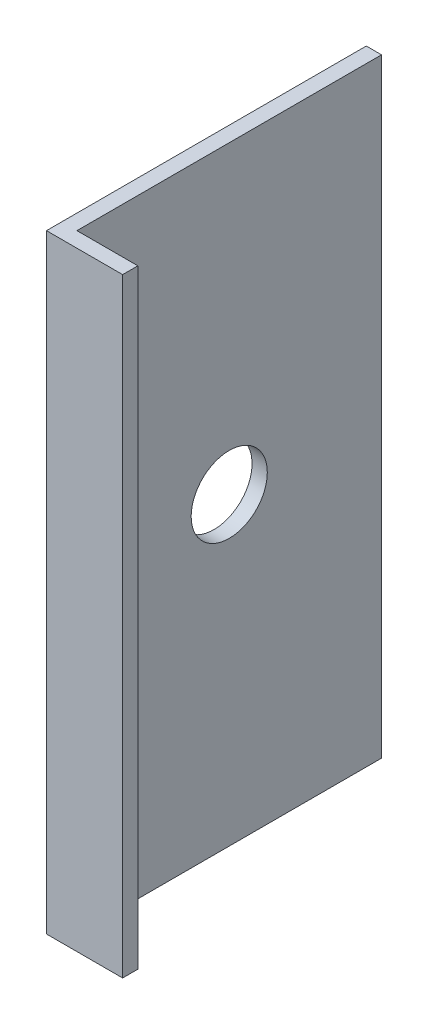
ISO-10303-21;
HEADER;
FILE_DESCRIPTION(('STEP AP214'),'2;1');
FILE_NAME('part.step','',(''),(''),'','','');
FILE_SCHEMA(('AUTOMOTIVE_DESIGN { 1 0 10303 214 1 1 1 1 }'));
ENDSEC;
DATA;
#1=APPLICATION_CONTEXT('core data for automotive mechanical design processes');
#2=APPLICATION_PROTOCOL_DEFINITION('international standard','automotive_design',2000,#1);
#3=PRODUCT_CONTEXT('',#1,'mechanical');
#4=PRODUCT('Part','Part','',(#3));
#5=PRODUCT_RELATED_PRODUCT_CATEGORY('part','',(#4));
#6=PRODUCT_DEFINITION_FORMATION('','',#4);
#7=PRODUCT_DEFINITION_CONTEXT('part definition',#1,'design');
#8=PRODUCT_DEFINITION('design','',#6,#7);
#9=PRODUCT_DEFINITION_SHAPE('','',#8);
#10=(LENGTH_UNIT() NAMED_UNIT(*) SI_UNIT(.MILLI.,.METRE.));
#11=(NAMED_UNIT(*) PLANE_ANGLE_UNIT() SI_UNIT($,.RADIAN.));
#12=(NAMED_UNIT(*) SI_UNIT($,.STERADIAN.) SOLID_ANGLE_UNIT());
#13=UNCERTAINTY_MEASURE_WITH_UNIT(LENGTH_MEASURE(1.E-05),#10,'distance_accuracy_value','');
#14=(GEOMETRIC_REPRESENTATION_CONTEXT(3) GLOBAL_UNCERTAINTY_ASSIGNED_CONTEXT((#13)) GLOBAL_UNIT_ASSIGNED_CONTEXT((#10,
#11,#12)) REPRESENTATION_CONTEXT('',''));
#15=CARTESIAN_POINT('',(0.,0.,0.));
#16=DIRECTION('',(0.,0.,1.));
#17=DIRECTION('',(1.,0.,0.));
#18=AXIS2_PLACEMENT_3D('',#15,#16,#17);
#19=CARTESIAN_POINT('',(0.,80.,0.));
#20=DIRECTION('',(0.,0.,-1.));
#21=DIRECTION('',(-1.,0.,0.));
#22=AXIS2_PLACEMENT_3D('',#19,#20,#21);
#23=PLANE('',#22);
#24=DIRECTION('',(1.,0.,0.));
#25=VECTOR('',#24,1.);
#26=CARTESIAN_POINT('',(0.,0.,0.));
#27=LINE('',#26,#25);
#28=CARTESIAN_POINT('',(0.,0.,0.));
#29=VERTEX_POINT('',#28);
#30=CARTESIAN_POINT('',(10.,0.,0.));
#31=VERTEX_POINT('',#30);
#32=EDGE_CURVE('E116',#29,#31,#27,.T.);
#33=ORIENTED_EDGE('',*,*,#32,.T.);
#34=DIRECTION('',(0.,-1.,0.));
#35=VECTOR('',#34,1.);
#36=CARTESIAN_POINT('',(10.,80.,0.));
#37=LINE('',#36,#35);
#38=CARTESIAN_POINT('',(10.,80.,0.));
#39=VERTEX_POINT('',#38);
#40=EDGE_CURVE('E11',#39,#31,#37,.T.);
#41=ORIENTED_EDGE('',*,*,#40,.F.);
#42=DIRECTION('',(1.,0.,0.));
#43=VECTOR('',#42,1.);
#44=CARTESIAN_POINT('',(0.,80.,0.));
#45=LINE('',#44,#43);
#46=CARTESIAN_POINT('',(0.,80.,0.));
#47=VERTEX_POINT('',#46);
#48=EDGE_CURVE('E81',#47,#39,#45,.T.);
#49=ORIENTED_EDGE('',*,*,#48,.F.);
#50=DIRECTION('',(0.,-1.,0.));
#51=VECTOR('',#50,1.);
#52=CARTESIAN_POINT('',(0.,80.,0.));
#53=LINE('',#52,#51);
#54=EDGE_CURVE('E112',#47,#29,#53,.T.);
#55=ORIENTED_EDGE('',*,*,#54,.T.);
#56=EDGE_LOOP('',(#33,#41,#49,#55));
#57=FACE_BOUND('',#56,.T.);
#58=ADVANCED_FACE('F35',(#57),#23,.F.);
#59=CARTESIAN_POINT('',(10.,80.,-2.));
#60=DIRECTION('',(1.,0.,0.));
#61=DIRECTION('',(0.,0.,-1.));
#62=AXIS2_PLACEMENT_3D('',#59,#60,#61);
#63=PLANE('',#62);
#64=DIRECTION('',(0.,0.,1.));
#65=VECTOR('',#64,1.);
#66=CARTESIAN_POINT('',(10.,0.,-2.));
#67=LINE('',#66,#65);
#68=CARTESIAN_POINT('',(10.,0.,-2.));
#69=VERTEX_POINT('',#68);
#70=EDGE_CURVE('E119',#69,#31,#67,.T.);
#71=ORIENTED_EDGE('',*,*,#70,.F.);
#72=DIRECTION('',(0.,-1.,0.));
#73=VECTOR('',#72,1.);
#74=CARTESIAN_POINT('',(10.,80.,-2.));
#75=LINE('',#74,#73);
#76=CARTESIAN_POINT('',(10.,80.,-2.));
#77=VERTEX_POINT('',#76);
#78=EDGE_CURVE('E43',#77,#69,#75,.T.);
#79=ORIENTED_EDGE('',*,*,#78,.F.);
#80=DIRECTION('',(0.,0.,1.));
#81=VECTOR('',#80,1.);
#82=CARTESIAN_POINT('',(10.,80.,-2.));
#83=LINE('',#82,#81);
#84=EDGE_CURVE('E179',#77,#39,#83,.T.);
#85=ORIENTED_EDGE('',*,*,#84,.T.);
#86=ORIENTED_EDGE('',*,*,#40,.T.);
#87=EDGE_LOOP('',(#71,#79,#85,#86));
#88=FACE_BOUND('',#87,.T.);
#89=ADVANCED_FACE('F138',(#88),#63,.T.);
#90=CARTESIAN_POINT('',(0.,80.,-2.));
#91=DIRECTION('',(0.,0.,-1.));
#92=DIRECTION('',(-1.,0.,0.));
#93=AXIS2_PLACEMENT_3D('',#90,#91,#92);
#94=PLANE('',#93);
#95=DIRECTION('',(1.,0.,0.));
#96=VECTOR('',#95,1.);
#97=CARTESIAN_POINT('',(0.,0.,-2.));
#98=LINE('',#97,#96);
#99=CARTESIAN_POINT('',(2.,0.,-2.));
#100=VERTEX_POINT('',#99);
#101=EDGE_CURVE('E123',#100,#69,#98,.T.);
#102=ORIENTED_EDGE('',*,*,#101,.F.);
#103=DIRECTION('',(0.,-1.,0.));
#104=VECTOR('',#103,1.);
#105=CARTESIAN_POINT('',(2.,80.,-2.));
#106=LINE('',#105,#104);
#107=CARTESIAN_POINT('',(2.,80.,-2.));
#108=VERTEX_POINT('',#107);
#109=EDGE_CURVE('E102',#108,#100,#106,.T.);
#110=ORIENTED_EDGE('',*,*,#109,.F.);
#111=DIRECTION('',(1.,0.,0.));
#112=VECTOR('',#111,1.);
#113=CARTESIAN_POINT('',(0.,80.,-2.));
#114=LINE('',#113,#112);
#115=EDGE_CURVE('E108',#108,#77,#114,.T.);
#116=ORIENTED_EDGE('',*,*,#115,.T.);
#117=ORIENTED_EDGE('',*,*,#78,.T.);
#118=EDGE_LOOP('',(#102,#110,#116,#117));
#119=FACE_BOUND('',#118,.T.);
#120=ADVANCED_FACE('F135',(#119),#94,.T.);
#121=CARTESIAN_POINT('',(2.,80.,0.));
#122=DIRECTION('',(1.,0.,0.));
#123=DIRECTION('',(0.,0.,-1.));
#124=AXIS2_PLACEMENT_3D('',#121,#122,#123);
#125=PLANE('',#124);
#126=CARTESIAN_POINT('',(2.,40.,-22.));
#127=DIRECTION('',(1.,0.,0.));
#128=DIRECTION('',(0.,0.,-1.));
#129=AXIS2_PLACEMENT_3D('',#126,#127,#128);
#130=CIRCLE('',#129,5.);
#131=CARTESIAN_POINT('',(2.,40.,-27.));
#132=VERTEX_POINT('',#131);
#133=EDGE_CURVE('E120',#132,#132,#130,.T.);
#134=ORIENTED_EDGE('',*,*,#133,.F.);
#135=EDGE_LOOP('',(#134));
#136=FACE_BOUND('',#135,.T.);
#137=DIRECTION('',(0.,0.,-1.));
#138=VECTOR('',#137,1.);
#139=CARTESIAN_POINT('',(2.,0.,0.));
#140=LINE('',#139,#138);
#141=CARTESIAN_POINT('',(2.,0.,-42.));
#142=VERTEX_POINT('',#141);
#143=EDGE_CURVE('E97',#142,#100,#140,.F.);
#144=ORIENTED_EDGE('',*,*,#143,.F.);
#145=DIRECTION('',(0.,-1.,0.));
#146=VECTOR('',#145,1.);
#147=CARTESIAN_POINT('',(2.,80.,-42.));
#148=LINE('',#147,#146);
#149=CARTESIAN_POINT('',(2.,80.,-42.));
#150=VERTEX_POINT('',#149);
#151=EDGE_CURVE('E92',#150,#142,#148,.T.);
#152=ORIENTED_EDGE('',*,*,#151,.F.);
#153=DIRECTION('',(0.,0.,-1.));
#154=VECTOR('',#153,1.);
#155=CARTESIAN_POINT('',(2.,80.,0.));
#156=LINE('',#155,#154);
#157=EDGE_CURVE('E95',#150,#108,#156,.F.);
#158=ORIENTED_EDGE('',*,*,#157,.T.);
#159=ORIENTED_EDGE('',*,*,#109,.T.);
#160=EDGE_LOOP('',(#144,#152,#158,#159));
#161=FACE_BOUND('',#160,.T.);
#162=ADVANCED_FACE('F94',(#136,#161),#125,.T.);
#163=CARTESIAN_POINT('',(0.,80.,-42.));
#164=DIRECTION('',(0.,0.,-1.));
#165=DIRECTION('',(-1.,0.,0.));
#166=AXIS2_PLACEMENT_3D('',#163,#164,#165);
#167=PLANE('',#166);
#168=DIRECTION('',(1.,0.,0.));
#169=VECTOR('',#168,1.);
#170=CARTESIAN_POINT('',(0.,0.,-42.));
#171=LINE('',#170,#169);
#172=CARTESIAN_POINT('',(0.,0.,-42.));
#173=VERTEX_POINT('',#172);
#174=EDGE_CURVE('E127',#173,#142,#171,.T.);
#175=ORIENTED_EDGE('',*,*,#174,.F.);
#176=DIRECTION('',(0.,-1.,0.));
#177=VECTOR('',#176,1.);
#178=CARTESIAN_POINT('',(0.,80.,-42.));
#179=LINE('',#178,#177);
#180=CARTESIAN_POINT('',(0.,80.,-42.));
#181=VERTEX_POINT('',#180);
#182=EDGE_CURVE('E72',#181,#173,#179,.T.);
#183=ORIENTED_EDGE('',*,*,#182,.F.);
#184=DIRECTION('',(1.,0.,0.));
#185=VECTOR('',#184,1.);
#186=CARTESIAN_POINT('',(0.,80.,-42.));
#187=LINE('',#186,#185);
#188=EDGE_CURVE('E106',#181,#150,#187,.T.);
#189=ORIENTED_EDGE('',*,*,#188,.T.);
#190=ORIENTED_EDGE('',*,*,#151,.T.);
#191=EDGE_LOOP('',(#175,#183,#189,#190));
#192=FACE_BOUND('',#191,.T.);
#193=ADVANCED_FACE('F110',(#192),#167,.T.);
#194=CARTESIAN_POINT('',(0.,80.,0.));
#195=DIRECTION('',(1.,0.,0.));
#196=DIRECTION('',(0.,0.,-1.));
#197=AXIS2_PLACEMENT_3D('',#194,#195,#196);
#198=PLANE('',#197);
#199=CARTESIAN_POINT('',(0.,40.,-22.));
#200=DIRECTION('',(-1.,0.,0.));
#201=DIRECTION('',(0.,0.,1.));
#202=AXIS2_PLACEMENT_3D('',#199,#200,#201);
#203=CIRCLE('',#202,5.);
#204=CARTESIAN_POINT('',(0.,40.,-17.));
#205=VERTEX_POINT('',#204);
#206=EDGE_CURVE('E173',#205,#205,#203,.T.);
#207=ORIENTED_EDGE('',*,*,#206,.F.);
#208=EDGE_LOOP('',(#207));
#209=FACE_BOUND('',#208,.T.);
#210=DIRECTION('',(0.,0.,1.));
#211=VECTOR('',#210,1.);
#212=CARTESIAN_POINT('',(0.,0.,0.));
#213=LINE('',#212,#211);
#214=EDGE_CURVE('E75',#173,#29,#213,.T.);
#215=ORIENTED_EDGE('',*,*,#214,.T.);
#216=ORIENTED_EDGE('',*,*,#54,.F.);
#217=DIRECTION('',(0.,0.,1.));
#218=VECTOR('',#217,1.);
#219=CARTESIAN_POINT('',(0.,80.,0.));
#220=LINE('',#219,#218);
#221=EDGE_CURVE('E51',#181,#47,#220,.T.);
#222=ORIENTED_EDGE('',*,*,#221,.F.);
#223=ORIENTED_EDGE('',*,*,#182,.T.);
#224=EDGE_LOOP('',(#215,#216,#222,#223));
#225=FACE_BOUND('',#224,.T.);
#226=ADVANCED_FACE('F143',(#209,#225),#198,.F.);
#227=CARTESIAN_POINT('',(0.,80.,0.));
#228=DIRECTION('',(0.,-1.,0.));
#229=DIRECTION('',(-1.,0.,0.));
#230=AXIS2_PLACEMENT_3D('',#227,#228,#229);
#231=PLANE('',#230);
#232=ORIENTED_EDGE('',*,*,#48,.T.);
#233=ORIENTED_EDGE('',*,*,#84,.F.);
#234=ORIENTED_EDGE('',*,*,#115,.F.);
#235=ORIENTED_EDGE('',*,*,#157,.F.);
#236=ORIENTED_EDGE('',*,*,#188,.F.);
#237=ORIENTED_EDGE('',*,*,#221,.T.);
#238=EDGE_LOOP('',(#232,#233,#234,#235,#236,#237));
#239=FACE_BOUND('',#238,.T.);
#240=ADVANCED_FACE('F105',(#239),#231,.F.);
#241=CARTESIAN_POINT('',(0.,0.,0.));
#242=DIRECTION('',(0.,-1.,0.));
#243=DIRECTION('',(-1.,0.,0.));
#244=AXIS2_PLACEMENT_3D('',#241,#242,#243);
#245=PLANE('',#244);
#246=ORIENTED_EDGE('',*,*,#32,.F.);
#247=ORIENTED_EDGE('',*,*,#214,.F.);
#248=ORIENTED_EDGE('',*,*,#174,.T.);
#249=ORIENTED_EDGE('',*,*,#143,.T.);
#250=ORIENTED_EDGE('',*,*,#101,.T.);
#251=ORIENTED_EDGE('',*,*,#70,.T.);
#252=EDGE_LOOP('',(#246,#247,#248,#249,#250,#251));
#253=FACE_BOUND('',#252,.T.);
#254=ADVANCED_FACE('F141',(#253),#245,.T.);
#255=CARTESIAN_POINT('',(10.,40.,-22.));
#256=DIRECTION('',(-1.,0.,0.));
#257=DIRECTION('',(0.,0.,1.));
#258=AXIS2_PLACEMENT_3D('',#255,#256,#257);
#259=CYLINDRICAL_SURFACE('',#258,5.);
#260=ORIENTED_EDGE('',*,*,#133,.T.);
#261=EDGE_LOOP('',(#260));
#262=FACE_BOUND('',#261,.T.);
#263=ORIENTED_EDGE('',*,*,#206,.T.);
#264=EDGE_LOOP('',(#263));
#265=FACE_BOUND('',#264,.T.);
#266=ADVANCED_FACE('F181',(#262,#265),#259,.F.);
#267=CLOSED_SHELL('',(#58,#89,#120,#162,#193,#226,#240,#254,#266));
#268=MANIFOLD_SOLID_BREP('B2',#267);
#269=ADVANCED_BREP_SHAPE_REPRESENTATION('',(#18,#268),#14);
#270=SHAPE_DEFINITION_REPRESENTATION(#9,#269);
ENDSEC;
END-ISO-10303-21;
